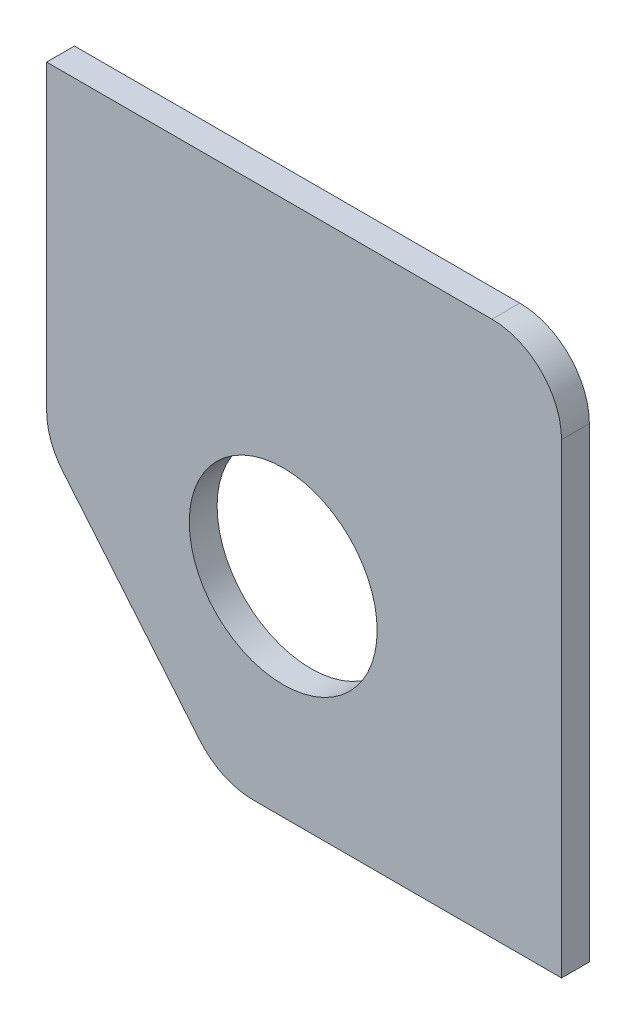
ISO-10303-21;
HEADER;
FILE_DESCRIPTION(('STEP AP214'),'2;1');
FILE_NAME('part.step','',(''),(''),'','','');
FILE_SCHEMA(('AUTOMOTIVE_DESIGN { 1 0 10303 214 1 1 1 1 }'));
ENDSEC;
DATA;
#1=APPLICATION_CONTEXT('core data for automotive mechanical design processes');
#2=APPLICATION_PROTOCOL_DEFINITION('international standard','automotive_design',2000,#1);
#3=PRODUCT_CONTEXT('',#1,'mechanical');
#4=PRODUCT('Part','Part','',(#3));
#5=PRODUCT_RELATED_PRODUCT_CATEGORY('part','',(#4));
#6=PRODUCT_DEFINITION_FORMATION('','',#4);
#7=PRODUCT_DEFINITION_CONTEXT('part definition',#1,'design');
#8=PRODUCT_DEFINITION('design','',#6,#7);
#9=PRODUCT_DEFINITION_SHAPE('','',#8);
#10=(LENGTH_UNIT() NAMED_UNIT(*) SI_UNIT(.MILLI.,.METRE.));
#11=(NAMED_UNIT(*) PLANE_ANGLE_UNIT() SI_UNIT($,.RADIAN.));
#12=(NAMED_UNIT(*) SI_UNIT($,.STERADIAN.) SOLID_ANGLE_UNIT());
#13=UNCERTAINTY_MEASURE_WITH_UNIT(LENGTH_MEASURE(1.E-05),#10,'distance_accuracy_value','');
#14=(GEOMETRIC_REPRESENTATION_CONTEXT(3) GLOBAL_UNCERTAINTY_ASSIGNED_CONTEXT((#13)) GLOBAL_UNIT_ASSIGNED_CONTEXT((#10,
#11,#12)) REPRESENTATION_CONTEXT('',''));
#15=CARTESIAN_POINT('',(0.,0.,0.));
#16=DIRECTION('',(0.,0.,1.));
#17=DIRECTION('',(1.,0.,0.));
#18=AXIS2_PLACEMENT_3D('',#15,#16,#17);
#19=CARTESIAN_POINT('',(-22.1656855955678,34.0263157894737,4.));
#20=DIRECTION('',(0.,0.,-1.));
#21=DIRECTION('',(-1.,0.,0.));
#22=AXIS2_PLACEMENT_3D('',#19,#20,#21);
#23=CYLINDRICAL_SURFACE('',#22,10.);
#24=DIRECTION('',(0.,0.,-1.));
#25=VECTOR('',#24,1.);
#26=CARTESIAN_POINT('',(-22.1656855955678,44.0263157894737,4.));
#27=LINE('',#26,#25);
#28=CARTESIAN_POINT('',(-22.1656855955678,44.0263157894737,4.));
#29=VERTEX_POINT('',#28);
#30=CARTESIAN_POINT('',(-22.1656855955678,44.0263157894737,0.));
#31=VERTEX_POINT('',#30);
#32=EDGE_CURVE('E152',#29,#31,#27,.T.);
#33=ORIENTED_EDGE('',*,*,#32,.F.);
#34=CARTESIAN_POINT('',(-22.1656855955678,34.0263157894737,4.));
#35=DIRECTION('',(0.,0.,1.));
#36=DIRECTION('',(1.,0.,0.));
#37=AXIS2_PLACEMENT_3D('',#34,#35,#36);
#38=CIRCLE('',#37,10.);
#39=CARTESIAN_POINT('',(-12.1656855955678,34.0263157894737,4.));
#40=VERTEX_POINT('',#39);
#41=EDGE_CURVE('E40',#40,#29,#38,.T.);
#42=ORIENTED_EDGE('',*,*,#41,.F.);
#43=DIRECTION('',(0.,0.,-1.));
#44=VECTOR('',#43,1.);
#45=CARTESIAN_POINT('',(-12.1656855955678,34.0263157894737,4.));
#46=LINE('',#45,#44);
#47=CARTESIAN_POINT('',(-12.1656855955678,34.0263157894737,0.));
#48=VERTEX_POINT('',#47);
#49=EDGE_CURVE('E118',#48,#40,#46,.F.);
#50=ORIENTED_EDGE('',*,*,#49,.F.);
#51=CARTESIAN_POINT('',(-22.1656855955678,34.0263157894737,0.));
#52=DIRECTION('',(0.,0.,1.));
#53=DIRECTION('',(1.,0.,0.));
#54=AXIS2_PLACEMENT_3D('',#51,#52,#53);
#55=CIRCLE('',#54,10.);
#56=EDGE_CURVE('E11',#31,#48,#55,.F.);
#57=ORIENTED_EDGE('',*,*,#56,.F.);
#58=EDGE_LOOP('',(#33,#42,#50,#57));
#59=FACE_BOUND('',#58,.T.);
#60=ADVANCED_FACE('F33',(#59),#23,.T.);
#61=CARTESIAN_POINT('',(-56.4819361357234,-22.9736842105263,137.586348479177));
#62=DIRECTION('',(0.,0.,-1.));
#63=DIRECTION('',(-1.,0.,0.));
#64=AXIS2_PLACEMENT_3D('',#61,#62,#63);
#65=CYLINDRICAL_SURFACE('',#64,10.);
#66=DIRECTION('',(0.,0.,1.));
#67=VECTOR('',#66,1.);
#68=CARTESIAN_POINT('',(-64.1641489316971,-29.3755282071711,137.586348479177));
#69=LINE('',#68,#67);
#70=CARTESIAN_POINT('',(-64.1641489316971,-29.3755282071711,0.));
#71=VERTEX_POINT('',#70);
#72=CARTESIAN_POINT('',(-64.1641489316971,-29.3755282071711,4.));
#73=VERTEX_POINT('',#72);
#74=EDGE_CURVE('E144',#71,#73,#69,.T.);
#75=ORIENTED_EDGE('',*,*,#74,.F.);
#76=CARTESIAN_POINT('',(-56.4819361357234,-22.9736842105263,0.));
#77=DIRECTION('',(0.,0.,1.));
#78=DIRECTION('',(1.,0.,0.));
#79=AXIS2_PLACEMENT_3D('',#76,#77,#78);
#80=CIRCLE('',#79,10.);
#81=CARTESIAN_POINT('',(-56.4819361357234,-32.9736842105263,0.));
#82=VERTEX_POINT('',#81);
#83=EDGE_CURVE('E149',#82,#71,#80,.F.);
#84=ORIENTED_EDGE('',*,*,#83,.F.);
#85=DIRECTION('',(0.,0.,1.));
#86=VECTOR('',#85,1.);
#87=CARTESIAN_POINT('',(-56.4819361357234,-32.9736842105263,137.586348479177));
#88=LINE('',#87,#86);
#89=CARTESIAN_POINT('',(-56.4819361357234,-32.9736842105263,4.));
#90=VERTEX_POINT('',#89);
#91=EDGE_CURVE('E147',#90,#82,#88,.F.);
#92=ORIENTED_EDGE('',*,*,#91,.F.);
#93=CARTESIAN_POINT('',(-56.4819361357234,-22.9736842105263,4.));
#94=DIRECTION('',(0.,0.,1.));
#95=DIRECTION('',(1.,0.,0.));
#96=AXIS2_PLACEMENT_3D('',#93,#94,#95);
#97=CIRCLE('',#96,10.);
#98=EDGE_CURVE('E101',#73,#90,#97,.T.);
#99=ORIENTED_EDGE('',*,*,#98,.F.);
#100=EDGE_LOOP('',(#75,#84,#92,#99));
#101=FACE_BOUND('',#100,.T.);
#102=ADVANCED_FACE('F183',(#101),#65,.T.);
#103=CARTESIAN_POINT('',(-76.1656855955678,0.646815141287005,4.));
#104=DIRECTION('',(0.,0.,-1.));
#105=DIRECTION('',(-1.,0.,0.));
#106=AXIS2_PLACEMENT_3D('',#103,#104,#105);
#107=CYLINDRICAL_SURFACE('',#106,10.);
#108=DIRECTION('',(0.,0.,1.));
#109=VECTOR('',#108,1.);
#110=CARTESIAN_POINT('',(-86.1656855955678,0.646815141287005,4.));
#111=LINE('',#110,#109);
#112=CARTESIAN_POINT('',(-86.1656855955678,0.646815141287005,0.));
#113=VERTEX_POINT('',#112);
#114=CARTESIAN_POINT('',(-86.1656855955678,0.646815141287005,4.));
#115=VERTEX_POINT('',#114);
#116=EDGE_CURVE('E114',#113,#115,#111,.T.);
#117=ORIENTED_EDGE('',*,*,#116,.F.);
#118=CARTESIAN_POINT('',(-76.1656855955678,0.646815141287005,0.));
#119=DIRECTION('',(0.,0.,1.));
#120=DIRECTION('',(1.,0.,0.));
#121=AXIS2_PLACEMENT_3D('',#118,#119,#120);
#122=CIRCLE('',#121,10.);
#123=CARTESIAN_POINT('',(-83.8478983915416,-5.75502885535779,0.));
#124=VERTEX_POINT('',#123);
#125=EDGE_CURVE('E140',#124,#113,#122,.F.);
#126=ORIENTED_EDGE('',*,*,#125,.F.);
#127=DIRECTION('',(0.,0.,1.));
#128=VECTOR('',#127,1.);
#129=CARTESIAN_POINT('',(-83.8478983915416,-5.75502885535779,4.));
#130=LINE('',#129,#128);
#131=CARTESIAN_POINT('',(-83.8478983915416,-5.75502885535779,4.));
#132=VERTEX_POINT('',#131);
#133=EDGE_CURVE('E137',#132,#124,#130,.F.);
#134=ORIENTED_EDGE('',*,*,#133,.F.);
#135=CARTESIAN_POINT('',(-76.1656855955678,0.646815141287005,4.));
#136=DIRECTION('',(0.,0.,1.));
#137=DIRECTION('',(1.,0.,0.));
#138=AXIS2_PLACEMENT_3D('',#135,#136,#137);
#139=CIRCLE('',#138,10.);
#140=EDGE_CURVE('E142',#115,#132,#139,.T.);
#141=ORIENTED_EDGE('',*,*,#140,.F.);
#142=EDGE_LOOP('',(#117,#126,#134,#141));
#143=FACE_BOUND('',#142,.T.);
#144=ADVANCED_FACE('F185',(#143),#107,.T.);
#145=CARTESIAN_POINT('',(0.,0.,4.));
#146=DIRECTION('',(0.,0.,1.));
#147=DIRECTION('',(1.,0.,0.));
#148=AXIS2_PLACEMENT_3D('',#145,#146,#147);
#149=PLANE('',#148);
#150=CARTESIAN_POINT('',(-52.1656855955678,-2.97368421052632,4.));
#151=DIRECTION('',(0.,0.,1.));
#152=DIRECTION('',(1.,0.,0.));
#153=AXIS2_PLACEMENT_3D('',#150,#151,#152);
#154=CIRCLE('',#153,13.5);
#155=CARTESIAN_POINT('',(-38.6656855955678,-2.97368421052632,4.));
#156=VERTEX_POINT('',#155);
#157=EDGE_CURVE('E127',#156,#156,#154,.F.);
#158=ORIENTED_EDGE('',*,*,#157,.T.);
#159=EDGE_LOOP('',(#158));
#160=FACE_BOUND('',#159,.T.);
#161=DIRECTION('',(0.,1.,0.));
#162=VECTOR('',#161,1.);
#163=CARTESIAN_POINT('',(-12.1656855955678,44.0263157894737,4.));
#164=LINE('',#163,#162);
#165=CARTESIAN_POINT('',(-12.1656855955678,-32.9736842105263,4.));
#166=VERTEX_POINT('',#165);
#167=EDGE_CURVE('E99',#166,#40,#164,.T.);
#168=ORIENTED_EDGE('',*,*,#167,.T.);
#169=ORIENTED_EDGE('',*,*,#41,.T.);
#170=DIRECTION('',(-1.,0.,0.));
#171=VECTOR('',#170,1.);
#172=CARTESIAN_POINT('',(-86.1656855955678,44.0263157894737,4.));
#173=LINE('',#172,#171);
#174=CARTESIAN_POINT('',(-86.1656855955678,44.0263157894737,4.));
#175=VERTEX_POINT('',#174);
#176=EDGE_CURVE('E119',#29,#175,#173,.T.);
#177=ORIENTED_EDGE('',*,*,#176,.T.);
#178=DIRECTION('',(0.,-1.,0.));
#179=VECTOR('',#178,1.);
#180=CARTESIAN_POINT('',(-86.1656855955678,44.0263157894737,4.));
#181=LINE('',#180,#179);
#182=EDGE_CURVE('E105',#175,#115,#181,.T.);
#183=ORIENTED_EDGE('',*,*,#182,.T.);
#184=ORIENTED_EDGE('',*,*,#140,.T.);
#185=DIRECTION('',(0.64018439966448,-0.768221279597376,0.));
#186=VECTOR('',#185,1.);
#187=CARTESIAN_POINT('',(-52.3143476681349,-43.5952897234458,4.));
#188=LINE('',#187,#186);
#189=EDGE_CURVE('E171',#132,#73,#188,.T.);
#190=ORIENTED_EDGE('',*,*,#189,.T.);
#191=ORIENTED_EDGE('',*,*,#98,.T.);
#192=DIRECTION('',(1.,0.,0.));
#193=VECTOR('',#192,1.);
#194=CARTESIAN_POINT('',(-86.1656855955678,-32.9736842105263,4.));
#195=LINE('',#194,#193);
#196=EDGE_CURVE('E95',#90,#166,#195,.T.);
#197=ORIENTED_EDGE('',*,*,#196,.T.);
#198=EDGE_LOOP('',(#168,#169,#177,#183,#184,#190,#191,#197));
#199=FACE_BOUND('',#198,.T.);
#200=ADVANCED_FACE('F97',(#160,#199),#149,.T.);
#201=CARTESIAN_POINT('',(0.,0.,0.));
#202=DIRECTION('',(0.,0.,1.));
#203=DIRECTION('',(1.,0.,0.));
#204=AXIS2_PLACEMENT_3D('',#201,#202,#203);
#205=PLANE('',#204);
#206=CARTESIAN_POINT('',(-52.1656855955678,-2.97368421052632,0.));
#207=DIRECTION('',(0.,0.,1.));
#208=DIRECTION('',(1.,0.,0.));
#209=AXIS2_PLACEMENT_3D('',#206,#207,#208);
#210=CIRCLE('',#209,13.5);
#211=CARTESIAN_POINT('',(-38.6656855955678,-2.97368421052632,0.));
#212=VERTEX_POINT('',#211);
#213=EDGE_CURVE('E168',#212,#212,#210,.T.);
#214=ORIENTED_EDGE('',*,*,#213,.T.);
#215=EDGE_LOOP('',(#214));
#216=FACE_BOUND('',#215,.T.);
#217=DIRECTION('',(-1.,0.,0.));
#218=VECTOR('',#217,1.);
#219=CARTESIAN_POINT('',(-86.1656855955678,44.0263157894737,0.));
#220=LINE('',#219,#218);
#221=CARTESIAN_POINT('',(-86.1656855955678,44.0263157894737,0.));
#222=VERTEX_POINT('',#221);
#223=EDGE_CURVE('E131',#31,#222,#220,.T.);
#224=ORIENTED_EDGE('',*,*,#223,.F.);
#225=ORIENTED_EDGE('',*,*,#56,.T.);
#226=DIRECTION('',(0.,1.,0.));
#227=VECTOR('',#226,1.);
#228=CARTESIAN_POINT('',(-12.1656855955678,44.0263157894737,0.));
#229=LINE('',#228,#227);
#230=CARTESIAN_POINT('',(-12.1656855955678,-32.9736842105263,0.));
#231=VERTEX_POINT('',#230);
#232=EDGE_CURVE('E129',#231,#48,#229,.T.);
#233=ORIENTED_EDGE('',*,*,#232,.F.);
#234=DIRECTION('',(1.,0.,0.));
#235=VECTOR('',#234,1.);
#236=CARTESIAN_POINT('',(-86.1656855955678,-32.9736842105263,0.));
#237=LINE('',#236,#235);
#238=EDGE_CURVE('E111',#82,#231,#237,.T.);
#239=ORIENTED_EDGE('',*,*,#238,.F.);
#240=ORIENTED_EDGE('',*,*,#83,.T.);
#241=DIRECTION('',(0.64018439966448,-0.768221279597376,0.));
#242=VECTOR('',#241,1.);
#243=CARTESIAN_POINT('',(-52.3143476681349,-43.5952897234458,0.));
#244=LINE('',#243,#242);
#245=EDGE_CURVE('E173',#124,#71,#244,.T.);
#246=ORIENTED_EDGE('',*,*,#245,.F.);
#247=ORIENTED_EDGE('',*,*,#125,.T.);
#248=DIRECTION('',(0.,-1.,0.));
#249=VECTOR('',#248,1.);
#250=CARTESIAN_POINT('',(-86.1656855955678,44.0263157894737,0.));
#251=LINE('',#250,#249);
#252=EDGE_CURVE('E124',#222,#113,#251,.T.);
#253=ORIENTED_EDGE('',*,*,#252,.F.);
#254=EDGE_LOOP('',(#224,#225,#233,#239,#240,#246,#247,#253));
#255=FACE_BOUND('',#254,.T.);
#256=ADVANCED_FACE('F181',(#216,#255),#205,.F.);
#257=CARTESIAN_POINT('',(-86.1656855955678,44.0263157894737,4.));
#258=DIRECTION('',(1.,0.,0.));
#259=DIRECTION('',(0.,0.,-1.));
#260=AXIS2_PLACEMENT_3D('',#257,#258,#259);
#261=PLANE('',#260);
#262=ORIENTED_EDGE('',*,*,#252,.T.);
#263=ORIENTED_EDGE('',*,*,#116,.T.);
#264=ORIENTED_EDGE('',*,*,#182,.F.);
#265=DIRECTION('',(0.,0.,-1.));
#266=VECTOR('',#265,1.);
#267=CARTESIAN_POINT('',(-86.1656855955678,44.0263157894737,4.));
#268=LINE('',#267,#266);
#269=EDGE_CURVE('E115',#175,#222,#268,.T.);
#270=ORIENTED_EDGE('',*,*,#269,.T.);
#271=EDGE_LOOP('',(#262,#263,#264,#270));
#272=FACE_BOUND('',#271,.T.);
#273=ADVANCED_FACE('F163',(#272),#261,.F.);
#274=CARTESIAN_POINT('',(-86.1656855955678,-32.9736842105263,4.));
#275=DIRECTION('',(0.,1.,0.));
#276=DIRECTION('',(0.,0.,1.));
#277=AXIS2_PLACEMENT_3D('',#274,#275,#276);
#278=PLANE('',#277);
#279=ORIENTED_EDGE('',*,*,#196,.F.);
#280=ORIENTED_EDGE('',*,*,#91,.T.);
#281=ORIENTED_EDGE('',*,*,#238,.T.);
#282=DIRECTION('',(0.,0.,-1.));
#283=VECTOR('',#282,1.);
#284=CARTESIAN_POINT('',(-12.1656855955678,-32.9736842105263,4.));
#285=LINE('',#284,#283);
#286=EDGE_CURVE('E108',#166,#231,#285,.T.);
#287=ORIENTED_EDGE('',*,*,#286,.F.);
#288=EDGE_LOOP('',(#279,#280,#281,#287));
#289=FACE_BOUND('',#288,.T.);
#290=ADVANCED_FACE('F109',(#289),#278,.F.);
#291=CARTESIAN_POINT('',(-12.1656855955678,44.0263157894737,4.));
#292=DIRECTION('',(-1.,0.,0.));
#293=DIRECTION('',(0.,-1.,0.));
#294=AXIS2_PLACEMENT_3D('',#291,#292,#293);
#295=PLANE('',#294);
#296=ORIENTED_EDGE('',*,*,#232,.T.);
#297=ORIENTED_EDGE('',*,*,#49,.T.);
#298=ORIENTED_EDGE('',*,*,#167,.F.);
#299=ORIENTED_EDGE('',*,*,#286,.T.);
#300=EDGE_LOOP('',(#296,#297,#298,#299));
#301=FACE_BOUND('',#300,.T.);
#302=ADVANCED_FACE('F117',(#301),#295,.F.);
#303=CARTESIAN_POINT('',(-86.1656855955678,44.0263157894737,4.));
#304=DIRECTION('',(0.,-1.,0.));
#305=DIRECTION('',(0.,0.,-1.));
#306=AXIS2_PLACEMENT_3D('',#303,#304,#305);
#307=PLANE('',#306);
#308=ORIENTED_EDGE('',*,*,#176,.F.);
#309=ORIENTED_EDGE('',*,*,#32,.T.);
#310=ORIENTED_EDGE('',*,*,#223,.T.);
#311=ORIENTED_EDGE('',*,*,#269,.F.);
#312=EDGE_LOOP('',(#308,#309,#310,#311));
#313=FACE_BOUND('',#312,.T.);
#314=ADVANCED_FACE('F159',(#313),#307,.F.);
#315=CARTESIAN_POINT('',(-52.1656855955678,-2.97368421052632,8.));
#316=DIRECTION('',(0.,0.,-1.));
#317=DIRECTION('',(-1.,0.,0.));
#318=AXIS2_PLACEMENT_3D('',#315,#316,#317);
#319=CYLINDRICAL_SURFACE('',#318,13.5);
#320=ORIENTED_EDGE('',*,*,#157,.F.);
#321=EDGE_LOOP('',(#320));
#322=FACE_BOUND('',#321,.T.);
#323=ORIENTED_EDGE('',*,*,#213,.F.);
#324=EDGE_LOOP('',(#323));
#325=FACE_BOUND('',#324,.T.);
#326=ADVANCED_FACE('F201',(#322,#325),#319,.F.);
#327=CARTESIAN_POINT('',(-61.1656855955678,-32.9736842105263,137.586348479177));
#328=DIRECTION('',(-0.768221279597376,-0.64018439966448,0.));
#329=DIRECTION('',(0.64018439966448,-0.768221279597376,0.));
#330=AXIS2_PLACEMENT_3D('',#327,#328,#329);
#331=PLANE('',#330);
#332=ORIENTED_EDGE('',*,*,#245,.T.);
#333=ORIENTED_EDGE('',*,*,#74,.T.);
#334=ORIENTED_EDGE('',*,*,#189,.F.);
#335=ORIENTED_EDGE('',*,*,#133,.T.);
#336=EDGE_LOOP('',(#332,#333,#334,#335));
#337=FACE_BOUND('',#336,.T.);
#338=ADVANCED_FACE('F177',(#337),#331,.T.);
#339=CLOSED_SHELL('',(#60,#102,#144,#200,#256,#273,#290,#302,#314,#326,#338));
#340=MANIFOLD_SOLID_BREP('B2',#339);
#341=ADVANCED_BREP_SHAPE_REPRESENTATION('',(#18,#340),#14);
#342=SHAPE_DEFINITION_REPRESENTATION(#9,#341);
ENDSEC;
END-ISO-10303-21;
